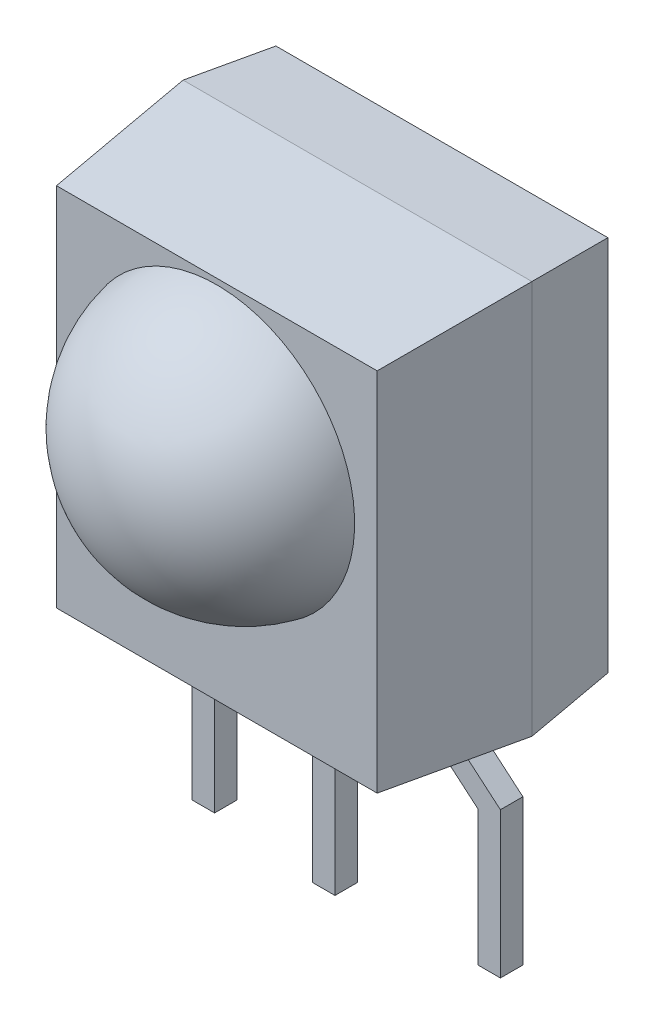
ISO-10303-21;
HEADER;
FILE_DESCRIPTION(('STEP AP214'),'2;1');
FILE_NAME('part.step','',(''),(''),'','','');
FILE_SCHEMA(('AUTOMOTIVE_DESIGN { 1 0 10303 214 1 1 1 1 }'));
ENDSEC;
DATA;
#1=APPLICATION_CONTEXT('core data for automotive mechanical design processes');
#2=APPLICATION_PROTOCOL_DEFINITION('international standard','automotive_design',2000,#1);
#3=PRODUCT_CONTEXT('',#1,'mechanical');
#4=PRODUCT('Part','Part','',(#3));
#5=PRODUCT_RELATED_PRODUCT_CATEGORY('part','',(#4));
#6=PRODUCT_DEFINITION_FORMATION('','',#4);
#7=PRODUCT_DEFINITION_CONTEXT('part definition',#1,'design');
#8=PRODUCT_DEFINITION('design','',#6,#7);
#9=PRODUCT_DEFINITION_SHAPE('','',#8);
#10=(LENGTH_UNIT() NAMED_UNIT(*) SI_UNIT(.MILLI.,.METRE.));
#11=(NAMED_UNIT(*) PLANE_ANGLE_UNIT() SI_UNIT($,.RADIAN.));
#12=(NAMED_UNIT(*) SI_UNIT($,.STERADIAN.) SOLID_ANGLE_UNIT());
#13=UNCERTAINTY_MEASURE_WITH_UNIT(LENGTH_MEASURE(1.E-05),#10,'distance_accuracy_value','');
#14=(GEOMETRIC_REPRESENTATION_CONTEXT(3) GLOBAL_UNCERTAINTY_ASSIGNED_CONTEXT((#13)) GLOBAL_UNIT_ASSIGNED_CONTEXT((#10,
#11,#12)) REPRESENTATION_CONTEXT('',''));
#15=CARTESIAN_POINT('',(0.,0.,0.));
#16=DIRECTION('',(0.,0.,1.));
#17=DIRECTION('',(1.,0.,0.));
#18=AXIS2_PLACEMENT_3D('',#15,#16,#17);
#19=CARTESIAN_POINT('',(-0.399999999999999,-3.5,0.4));
#20=DIRECTION('',(1.,0.,0.));
#21=DIRECTION('',(0.,1.,0.));
#22=AXIS2_PLACEMENT_3D('',#19,#20,#21);
#23=PLANE('',#22);
#24=DIRECTION('',(0.,-1.,0.));
#25=VECTOR('',#24,1.);
#26=CARTESIAN_POINT('',(-0.399999999999999,-3.5,0.));
#27=LINE('',#26,#25);
#28=CARTESIAN_POINT('',(-0.399999999999999,-3.5,0.));
#29=VERTEX_POINT('',#28);
#30=CARTESIAN_POINT('',(-0.399999999999999,-7.3,0.));
#31=VERTEX_POINT('',#30);
#32=EDGE_CURVE('E109',#29,#31,#27,.T.);
#33=ORIENTED_EDGE('',*,*,#32,.T.);
#34=DIRECTION('',(0.,0.,-1.));
#35=VECTOR('',#34,1.);
#36=CARTESIAN_POINT('',(-0.399999999999999,-7.3,0.4));
#37=LINE('',#36,#35);
#38=CARTESIAN_POINT('',(-0.399999999999999,-7.3,0.4));
#39=VERTEX_POINT('',#38);
#40=EDGE_CURVE('E12',#39,#31,#37,.T.);
#41=ORIENTED_EDGE('',*,*,#40,.F.);
#42=DIRECTION('',(0.,-1.,0.));
#43=VECTOR('',#42,1.);
#44=CARTESIAN_POINT('',(-0.399999999999999,-3.5,0.4));
#45=LINE('',#44,#43);
#46=CARTESIAN_POINT('',(-0.399999999999999,-3.5,0.4));
#47=VERTEX_POINT('',#46);
#48=EDGE_CURVE('E86',#47,#39,#45,.T.);
#49=ORIENTED_EDGE('',*,*,#48,.F.);
#50=DIRECTION('',(0.,0.,-1.));
#51=VECTOR('',#50,1.);
#52=CARTESIAN_POINT('',(-0.399999999999999,-3.5,0.4));
#53=LINE('',#52,#51);
#54=EDGE_CURVE('E62',#47,#29,#53,.T.);
#55=ORIENTED_EDGE('',*,*,#54,.T.);
#56=EDGE_LOOP('',(#33,#41,#49,#55));
#57=FACE_BOUND('',#56,.T.);
#58=ADVANCED_FACE('F46',(#57),#23,.F.);
#59=CARTESIAN_POINT('',(0.,-7.3,0.4));
#60=DIRECTION('',(0.,-1.,0.));
#61=DIRECTION('',(0.,0.,-1.));
#62=AXIS2_PLACEMENT_3D('',#59,#60,#61);
#63=PLANE('',#62);
#64=DIRECTION('',(-1.,0.,0.));
#65=VECTOR('',#64,1.);
#66=CARTESIAN_POINT('',(0.,-7.3,0.));
#67=LINE('',#66,#65);
#68=CARTESIAN_POINT('',(0.,-7.3,0.));
#69=VERTEX_POINT('',#68);
#70=EDGE_CURVE('E95',#69,#31,#67,.T.);
#71=ORIENTED_EDGE('',*,*,#70,.F.);
#72=DIRECTION('',(0.,0.,-1.));
#73=VECTOR('',#72,1.);
#74=CARTESIAN_POINT('',(0.,-7.3,0.4));
#75=LINE('',#74,#73);
#76=CARTESIAN_POINT('',(0.,-7.3,0.4));
#77=VERTEX_POINT('',#76);
#78=EDGE_CURVE('E54',#77,#69,#75,.T.);
#79=ORIENTED_EDGE('',*,*,#78,.F.);
#80=DIRECTION('',(-1.,0.,0.));
#81=VECTOR('',#80,1.);
#82=CARTESIAN_POINT('',(0.,-7.3,0.4));
#83=LINE('',#82,#81);
#84=EDGE_CURVE('E93',#77,#39,#83,.T.);
#85=ORIENTED_EDGE('',*,*,#84,.T.);
#86=ORIENTED_EDGE('',*,*,#40,.T.);
#87=EDGE_LOOP('',(#71,#79,#85,#86));
#88=FACE_BOUND('',#87,.T.);
#89=ADVANCED_FACE('F92',(#88),#63,.T.);
#90=CARTESIAN_POINT('',(0.,-3.5,0.4));
#91=DIRECTION('',(1.,0.,0.));
#92=DIRECTION('',(0.,1.,0.));
#93=AXIS2_PLACEMENT_3D('',#90,#91,#92);
#94=PLANE('',#93);
#95=DIRECTION('',(0.,-1.,0.));
#96=VECTOR('',#95,1.);
#97=CARTESIAN_POINT('',(0.,-3.5,0.));
#98=LINE('',#97,#96);
#99=CARTESIAN_POINT('',(0.,-3.5,0.));
#100=VERTEX_POINT('',#99);
#101=EDGE_CURVE('E112',#100,#69,#98,.T.);
#102=ORIENTED_EDGE('',*,*,#101,.F.);
#103=DIRECTION('',(0.,0.,-1.));
#104=VECTOR('',#103,1.);
#105=CARTESIAN_POINT('',(0.,-3.5,0.4));
#106=LINE('',#105,#104);
#107=CARTESIAN_POINT('',(0.,-3.5,0.4));
#108=VERTEX_POINT('',#107);
#109=EDGE_CURVE('E75',#108,#100,#106,.T.);
#110=ORIENTED_EDGE('',*,*,#109,.F.);
#111=DIRECTION('',(0.,-1.,0.));
#112=VECTOR('',#111,1.);
#113=CARTESIAN_POINT('',(0.,-3.5,0.4));
#114=LINE('',#113,#112);
#115=EDGE_CURVE('E101',#108,#77,#114,.T.);
#116=ORIENTED_EDGE('',*,*,#115,.T.);
#117=ORIENTED_EDGE('',*,*,#78,.T.);
#118=EDGE_LOOP('',(#102,#110,#116,#117));
#119=FACE_BOUND('',#118,.T.);
#120=ADVANCED_FACE('F103',(#119),#94,.T.);
#121=CARTESIAN_POINT('',(-0.399999999999999,-3.5,0.4));
#122=DIRECTION('',(0.,1.,0.));
#123=DIRECTION('',(0.,0.,1.));
#124=AXIS2_PLACEMENT_3D('',#121,#122,#123);
#125=PLANE('',#124);
#126=DIRECTION('',(1.,0.,0.));
#127=VECTOR('',#126,1.);
#128=CARTESIAN_POINT('',(-0.399999999999999,-3.5,0.));
#129=LINE('',#128,#127);
#130=EDGE_CURVE('E114',#29,#100,#129,.T.);
#131=ORIENTED_EDGE('',*,*,#130,.F.);
#132=ORIENTED_EDGE('',*,*,#54,.F.);
#133=DIRECTION('',(1.,0.,0.));
#134=VECTOR('',#133,1.);
#135=CARTESIAN_POINT('',(-0.399999999999999,-3.5,0.4));
#136=LINE('',#135,#134);
#137=EDGE_CURVE('E104',#47,#108,#136,.T.);
#138=ORIENTED_EDGE('',*,*,#137,.T.);
#139=ORIENTED_EDGE('',*,*,#109,.T.);
#140=EDGE_LOOP('',(#131,#132,#138,#139));
#141=FACE_BOUND('',#140,.T.);
#142=ADVANCED_FACE('F120',(#141),#125,.T.);
#143=CARTESIAN_POINT('',(0.,0.,0.4));
#144=DIRECTION('',(0.,0.,-1.));
#145=DIRECTION('',(-1.,0.,0.));
#146=AXIS2_PLACEMENT_3D('',#143,#144,#145);
#147=PLANE('',#146);
#148=ORIENTED_EDGE('',*,*,#48,.T.);
#149=ORIENTED_EDGE('',*,*,#84,.F.);
#150=ORIENTED_EDGE('',*,*,#115,.F.);
#151=ORIENTED_EDGE('',*,*,#137,.F.);
#152=EDGE_LOOP('',(#148,#149,#150,#151));
#153=FACE_BOUND('',#152,.T.);
#154=ADVANCED_FACE('F100',(#153),#147,.F.);
#155=CARTESIAN_POINT('',(0.,0.,0.));
#156=DIRECTION('',(0.,0.,-1.));
#157=DIRECTION('',(-1.,0.,0.));
#158=AXIS2_PLACEMENT_3D('',#155,#156,#157);
#159=PLANE('',#158);
#160=ORIENTED_EDGE('',*,*,#32,.F.);
#161=ORIENTED_EDGE('',*,*,#130,.T.);
#162=ORIENTED_EDGE('',*,*,#101,.T.);
#163=ORIENTED_EDGE('',*,*,#70,.T.);
#164=EDGE_LOOP('',(#160,#161,#162,#163));
#165=FACE_BOUND('',#164,.T.);
#166=ADVANCED_FACE('F119',(#165),#159,.T.);
#167=CLOSED_SHELL('',(#58,#89,#120,#142,#154,#166));
#168=MANIFOLD_SOLID_BREP('B2',#167);
#169=CARTESIAN_POINT('',(-2.34,-4.8026672029627,0.2));
#170=DIRECTION('',(-1.,0.,0.));
#171=DIRECTION('',(0.,1.,0.));
#172=AXIS2_PLACEMENT_3D('',#169,#170,#171);
#173=PLANE('',#172);
#174=DIRECTION('',(0.,-1.,0.));
#175=VECTOR('',#174,1.);
#176=CARTESIAN_POINT('',(-2.34,-4.8026672029627,-0.2));
#177=LINE('',#176,#175);
#178=CARTESIAN_POINT('',(-2.34,-4.89526217276128,-0.2));
#179=VERTEX_POINT('',#178);
#180=CARTESIAN_POINT('',(-2.34,-7.3,-0.2));
#181=VERTEX_POINT('',#180);
#182=EDGE_CURVE('E276',#179,#181,#177,.T.);
#183=ORIENTED_EDGE('',*,*,#182,.F.);
#184=DIRECTION('',(0.,0.,-1.));
#185=VECTOR('',#184,1.);
#186=CARTESIAN_POINT('',(-2.34,-4.89526217276128,0.2));
#187=LINE('',#186,#185);
#188=CARTESIAN_POINT('',(-2.34,-4.89526217276128,0.2));
#189=VERTEX_POINT('',#188);
#190=EDGE_CURVE('E275',#189,#179,#187,.T.);
#191=ORIENTED_EDGE('',*,*,#190,.F.);
#192=DIRECTION('',(0.,-1.,0.));
#193=VECTOR('',#192,1.);
#194=CARTESIAN_POINT('',(-2.34,-4.8026672029627,0.2));
#195=LINE('',#194,#193);
#196=CARTESIAN_POINT('',(-2.34,-7.3,0.2));
#197=VERTEX_POINT('',#196);
#198=EDGE_CURVE('E290',#189,#197,#195,.T.);
#199=ORIENTED_EDGE('',*,*,#198,.T.);
#200=DIRECTION('',(0.,0.,-1.));
#201=VECTOR('',#200,1.);
#202=CARTESIAN_POINT('',(-2.34,-7.3,0.2));
#203=LINE('',#202,#201);
#204=EDGE_CURVE('E44',#197,#181,#203,.T.);
#205=ORIENTED_EDGE('',*,*,#204,.T.);
#206=EDGE_LOOP('',(#183,#191,#199,#205));
#207=FACE_BOUND('',#206,.T.);
#208=ADVANCED_FACE('F180',(#207),#173,.F.);
#209=CARTESIAN_POINT('',(-2.74,-7.3,0.2));
#210=DIRECTION('',(0.,-1.,0.));
#211=DIRECTION('',(0.,0.,-1.));
#212=AXIS2_PLACEMENT_3D('',#209,#210,#211);
#213=PLANE('',#212);
#214=DIRECTION('',(1.,0.,0.));
#215=VECTOR('',#214,1.);
#216=CARTESIAN_POINT('',(-2.74,-7.3,-0.2));
#217=LINE('',#216,#215);
#218=CARTESIAN_POINT('',(-2.74,-7.3,-0.2));
#219=VERTEX_POINT('',#218);
#220=EDGE_CURVE('E278',#219,#181,#217,.T.);
#221=ORIENTED_EDGE('',*,*,#220,.T.);
#222=ORIENTED_EDGE('',*,*,#204,.F.);
#223=DIRECTION('',(1.,0.,0.));
#224=VECTOR('',#223,1.);
#225=CARTESIAN_POINT('',(-2.74,-7.3,0.2));
#226=LINE('',#225,#224);
#227=CARTESIAN_POINT('',(-2.74,-7.3,0.2));
#228=VERTEX_POINT('',#227);
#229=EDGE_CURVE('E234',#228,#197,#226,.T.);
#230=ORIENTED_EDGE('',*,*,#229,.F.);
#231=DIRECTION('',(0.,0.,-1.));
#232=VECTOR('',#231,1.);
#233=CARTESIAN_POINT('',(-2.74,-7.3,0.2));
#234=LINE('',#233,#232);
#235=EDGE_CURVE('E188',#228,#219,#234,.T.);
#236=ORIENTED_EDGE('',*,*,#235,.T.);
#237=EDGE_LOOP('',(#221,#222,#230,#236));
#238=FACE_BOUND('',#237,.T.);
#239=ADVANCED_FACE('F303',(#238),#213,.T.);
#240=CARTESIAN_POINT('',(-2.74,-4.8026672029627,0.2));
#241=DIRECTION('',(-1.,0.,0.));
#242=DIRECTION('',(0.,1.,0.));
#243=AXIS2_PLACEMENT_3D('',#240,#241,#242);
#244=PLANE('',#243);
#245=DIRECTION('',(0.,-1.,0.));
#246=VECTOR('',#245,1.);
#247=CARTESIAN_POINT('',(-2.74,-4.8026672029627,-0.2));
#248=LINE('',#247,#246);
#249=CARTESIAN_POINT('',(-2.74,-4.71007223316413,-0.2));
#250=VERTEX_POINT('',#249);
#251=EDGE_CURVE('E280',#250,#219,#248,.T.);
#252=ORIENTED_EDGE('',*,*,#251,.T.);
#253=ORIENTED_EDGE('',*,*,#235,.F.);
#254=DIRECTION('',(0.,-1.,0.));
#255=VECTOR('',#254,1.);
#256=CARTESIAN_POINT('',(-2.74,-4.8026672029627,0.2));
#257=LINE('',#256,#255);
#258=CARTESIAN_POINT('',(-2.74,-4.71007223316413,0.2));
#259=VERTEX_POINT('',#258);
#260=EDGE_CURVE('E314',#259,#228,#257,.T.);
#261=ORIENTED_EDGE('',*,*,#260,.F.);
#262=DIRECTION('',(0.,0.,-1.));
#263=VECTOR('',#262,1.);
#264=CARTESIAN_POINT('',(-2.74,-4.71007223316413,0.2));
#265=LINE('',#264,#263);
#266=EDGE_CURVE('E297',#259,#250,#265,.T.);
#267=ORIENTED_EDGE('',*,*,#266,.T.);
#268=EDGE_LOOP('',(#252,#253,#261,#267));
#269=FACE_BOUND('',#268,.T.);
#270=ADVANCED_FACE('F322',(#269),#244,.T.);
#271=CARTESIAN_POINT('',(-1.93421000880941,-4.02637163457817,0.2));
#272=DIRECTION('',(-0.646977448195095,0.762509135372792,0.));
#273=DIRECTION('',(0.762509135372792,0.646977448195095,0.));
#274=AXIS2_PLACEMENT_3D('',#271,#272,#273);
#275=PLANE('',#274);
#276=DIRECTION('',(-0.762509135372792,-0.646977448195095,0.));
#277=VECTOR('',#276,1.);
#278=CARTESIAN_POINT('',(-1.93421000880941,-4.02637163457817,-0.2));
#279=LINE('',#278,#277);
#280=CARTESIAN_POINT('',(-2.00481451917039,-4.08627849185416,-0.2));
#281=VERTEX_POINT('',#280);
#282=EDGE_CURVE('E282',#281,#250,#279,.T.);
#283=ORIENTED_EDGE('',*,*,#282,.T.);
#284=ORIENTED_EDGE('',*,*,#266,.F.);
#285=DIRECTION('',(-0.762509135372792,-0.646977448195095,0.));
#286=VECTOR('',#285,1.);
#287=CARTESIAN_POINT('',(-1.93421000880941,-4.02637163457817,0.2));
#288=LINE('',#287,#286);
#289=CARTESIAN_POINT('',(-2.00481451917039,-4.08627849185416,0.2));
#290=VERTEX_POINT('',#289);
#291=EDGE_CURVE('E270',#290,#259,#288,.T.);
#292=ORIENTED_EDGE('',*,*,#291,.F.);
#293=DIRECTION('',(0.,0.,-1.));
#294=VECTOR('',#293,1.);
#295=CARTESIAN_POINT('',(-2.00481451917039,-4.08627849185416,0.2));
#296=LINE('',#295,#294);
#297=EDGE_CURVE('E294',#290,#281,#296,.T.);
#298=ORIENTED_EDGE('',*,*,#297,.T.);
#299=EDGE_LOOP('',(#283,#284,#292,#298));
#300=FACE_BOUND('',#299,.T.);
#301=ADVANCED_FACE('F321',(#300),#275,.T.);
#302=CARTESIAN_POINT('',(-2.00481451917039,-3.5,0.2));
#303=DIRECTION('',(-1.,0.,0.));
#304=DIRECTION('',(0.,0.,-1.));
#305=AXIS2_PLACEMENT_3D('',#302,#303,#304);
#306=PLANE('',#305);
#307=DIRECTION('',(0.,1.,0.));
#308=VECTOR('',#307,1.);
#309=CARTESIAN_POINT('',(-2.00481451917039,-3.5,-0.2));
#310=LINE('',#309,#308);
#311=CARTESIAN_POINT('',(-2.00481451917039,-3.5,-0.2));
#312=VERTEX_POINT('',#311);
#313=EDGE_CURVE('E284',#312,#281,#310,.F.);
#314=ORIENTED_EDGE('',*,*,#313,.T.);
#315=ORIENTED_EDGE('',*,*,#297,.F.);
#316=DIRECTION('',(0.,1.,0.));
#317=VECTOR('',#316,1.);
#318=CARTESIAN_POINT('',(-2.00481451917039,-3.5,0.2));
#319=LINE('',#318,#317);
#320=CARTESIAN_POINT('',(-2.00481451917039,-3.5,0.2));
#321=VERTEX_POINT('',#320);
#322=EDGE_CURVE('E268',#321,#290,#319,.F.);
#323=ORIENTED_EDGE('',*,*,#322,.F.);
#324=DIRECTION('',(0.,0.,-1.));
#325=VECTOR('',#324,1.);
#326=CARTESIAN_POINT('',(-2.00481451917039,-3.5,0.2));
#327=LINE('',#326,#325);
#328=EDGE_CURVE('E262',#321,#312,#327,.T.);
#329=ORIENTED_EDGE('',*,*,#328,.T.);
#330=EDGE_LOOP('',(#314,#315,#323,#329));
#331=FACE_BOUND('',#330,.T.);
#332=ADVANCED_FACE('F329',(#331),#306,.T.);
#333=CARTESIAN_POINT('',(-1.60481451917039,-3.5,0.2));
#334=DIRECTION('',(0.,1.,0.));
#335=DIRECTION('',(0.,0.,1.));
#336=AXIS2_PLACEMENT_3D('',#333,#334,#335);
#337=PLANE('',#336);
#338=DIRECTION('',(-1.,0.,0.));
#339=VECTOR('',#338,1.);
#340=CARTESIAN_POINT('',(-1.60481451917039,-3.5,-0.2));
#341=LINE('',#340,#339);
#342=CARTESIAN_POINT('',(-1.60481451917039,-3.5,-0.2));
#343=VERTEX_POINT('',#342);
#344=EDGE_CURVE('E286',#343,#312,#341,.T.);
#345=ORIENTED_EDGE('',*,*,#344,.T.);
#346=ORIENTED_EDGE('',*,*,#328,.F.);
#347=DIRECTION('',(-1.,0.,0.));
#348=VECTOR('',#347,1.);
#349=CARTESIAN_POINT('',(-1.60481451917039,-3.5,0.2));
#350=LINE('',#349,#348);
#351=CARTESIAN_POINT('',(-1.60481451917039,-3.5,0.2));
#352=VERTEX_POINT('',#351);
#353=EDGE_CURVE('E252',#352,#321,#350,.T.);
#354=ORIENTED_EDGE('',*,*,#353,.F.);
#355=DIRECTION('',(0.,0.,-1.));
#356=VECTOR('',#355,1.);
#357=CARTESIAN_POINT('',(-1.60481451917039,-3.5,0.2));
#358=LINE('',#357,#356);
#359=EDGE_CURVE('E257',#352,#343,#358,.T.);
#360=ORIENTED_EDGE('',*,*,#359,.T.);
#361=EDGE_LOOP('',(#345,#346,#354,#360));
#362=FACE_BOUND('',#361,.T.);
#363=ADVANCED_FACE('F265',(#362),#337,.T.);
#364=CARTESIAN_POINT('',(-1.60481451917039,-3.5,0.2));
#365=DIRECTION('',(-1.,0.,0.));
#366=DIRECTION('',(0.,0.,-1.));
#367=AXIS2_PLACEMENT_3D('',#364,#365,#366);
#368=PLANE('',#367);
#369=DIRECTION('',(0.,1.,0.));
#370=VECTOR('',#369,1.);
#371=CARTESIAN_POINT('',(-1.60481451917039,-3.5,-0.2));
#372=LINE('',#371,#370);
#373=CARTESIAN_POINT('',(-1.60481451917039,-4.27146843145131,-0.2));
#374=VERTEX_POINT('',#373);
#375=EDGE_CURVE('E259',#343,#374,#372,.F.);
#376=ORIENTED_EDGE('',*,*,#375,.F.);
#377=ORIENTED_EDGE('',*,*,#359,.F.);
#378=DIRECTION('',(0.,1.,0.));
#379=VECTOR('',#378,1.);
#380=CARTESIAN_POINT('',(-1.60481451917039,-3.5,0.2));
#381=LINE('',#380,#379);
#382=CARTESIAN_POINT('',(-1.60481451917039,-4.27146843145131,0.2));
#383=VERTEX_POINT('',#382);
#384=EDGE_CURVE('E248',#352,#383,#381,.F.);
#385=ORIENTED_EDGE('',*,*,#384,.T.);
#386=DIRECTION('',(0.,0.,-1.));
#387=VECTOR('',#386,1.);
#388=CARTESIAN_POINT('',(-1.60481451917039,-4.27146843145131,0.2));
#389=LINE('',#388,#387);
#390=EDGE_CURVE('E263',#383,#374,#389,.T.);
#391=ORIENTED_EDGE('',*,*,#390,.T.);
#392=EDGE_LOOP('',(#376,#377,#385,#391));
#393=FACE_BOUND('',#392,.T.);
#394=ADVANCED_FACE('F258',(#393),#368,.F.);
#395=CARTESIAN_POINT('',(-1.67541902953137,-4.33137528872729,0.2));
#396=DIRECTION('',(-0.646977448195095,0.762509135372792,0.));
#397=DIRECTION('',(0.762509135372792,0.646977448195095,0.));
#398=AXIS2_PLACEMENT_3D('',#395,#396,#397);
#399=PLANE('',#398);
#400=DIRECTION('',(-0.762509135372792,-0.646977448195095,0.));
#401=VECTOR('',#400,1.);
#402=CARTESIAN_POINT('',(-1.67541902953137,-4.33137528872729,-0.2));
#403=LINE('',#402,#401);
#404=EDGE_CURVE('E222',#374,#179,#403,.T.);
#405=ORIENTED_EDGE('',*,*,#404,.F.);
#406=ORIENTED_EDGE('',*,*,#390,.F.);
#407=DIRECTION('',(-0.762509135372792,-0.646977448195095,0.));
#408=VECTOR('',#407,1.);
#409=CARTESIAN_POINT('',(-1.67541902953137,-4.33137528872729,0.2));
#410=LINE('',#409,#408);
#411=EDGE_CURVE('E196',#383,#189,#410,.T.);
#412=ORIENTED_EDGE('',*,*,#411,.T.);
#413=ORIENTED_EDGE('',*,*,#190,.T.);
#414=EDGE_LOOP('',(#405,#406,#412,#413));
#415=FACE_BOUND('',#414,.T.);
#416=ADVANCED_FACE('F374',(#415),#399,.F.);
#417=CARTESIAN_POINT('',(0.,0.,0.2));
#418=DIRECTION('',(0.,0.,-1.));
#419=DIRECTION('',(1.,0.,0.));
#420=AXIS2_PLACEMENT_3D('',#417,#418,#419);
#421=PLANE('',#420);
#422=ORIENTED_EDGE('',*,*,#198,.F.);
#423=ORIENTED_EDGE('',*,*,#411,.F.);
#424=ORIENTED_EDGE('',*,*,#384,.F.);
#425=ORIENTED_EDGE('',*,*,#353,.T.);
#426=ORIENTED_EDGE('',*,*,#322,.T.);
#427=ORIENTED_EDGE('',*,*,#291,.T.);
#428=ORIENTED_EDGE('',*,*,#260,.T.);
#429=ORIENTED_EDGE('',*,*,#229,.T.);
#430=EDGE_LOOP('',(#422,#423,#424,#425,#426,#427,#428,#429));
#431=FACE_BOUND('',#430,.T.);
#432=ADVANCED_FACE('F250',(#431),#421,.F.);
#433=CARTESIAN_POINT('',(0.,0.,-0.2));
#434=DIRECTION('',(0.,0.,-1.));
#435=DIRECTION('',(1.,0.,0.));
#436=AXIS2_PLACEMENT_3D('',#433,#434,#435);
#437=PLANE('',#436);
#438=ORIENTED_EDGE('',*,*,#182,.T.);
#439=ORIENTED_EDGE('',*,*,#220,.F.);
#440=ORIENTED_EDGE('',*,*,#251,.F.);
#441=ORIENTED_EDGE('',*,*,#282,.F.);
#442=ORIENTED_EDGE('',*,*,#313,.F.);
#443=ORIENTED_EDGE('',*,*,#344,.F.);
#444=ORIENTED_EDGE('',*,*,#375,.T.);
#445=ORIENTED_EDGE('',*,*,#404,.T.);
#446=EDGE_LOOP('',(#438,#439,#440,#441,#442,#443,#444,#445));
#447=FACE_BOUND('',#446,.T.);
#448=ADVANCED_FACE('F307',(#447),#437,.T.);
#449=CLOSED_SHELL('',(#208,#239,#270,#301,#332,#363,#394,#416,#432,#448));
#450=MANIFOLD_SOLID_BREP('B6',#449);
#451=CARTESIAN_POINT('',(2.34,-4.8026672029627,0.2));
#452=DIRECTION('',(1.,0.,0.));
#453=DIRECTION('',(0.,1.,0.));
#454=AXIS2_PLACEMENT_3D('',#451,#452,#453);
#455=PLANE('',#454);
#456=DIRECTION('',(0.,-1.,0.));
#457=VECTOR('',#456,1.);
#458=CARTESIAN_POINT('',(2.34,-4.8026672029627,-0.2));
#459=LINE('',#458,#457);
#460=CARTESIAN_POINT('',(2.34,-4.89526217276128,-0.2));
#461=VERTEX_POINT('',#460);
#462=CARTESIAN_POINT('',(2.34,-7.3,-0.2));
#463=VERTEX_POINT('',#462);
#464=EDGE_CURVE('E514',#461,#463,#459,.T.);
#465=ORIENTED_EDGE('',*,*,#464,.T.);
#466=DIRECTION('',(0.,0.,-1.));
#467=VECTOR('',#466,1.);
#468=CARTESIAN_POINT('',(2.34,-7.3,0.2));
#469=LINE('',#468,#467);
#470=CARTESIAN_POINT('',(2.34,-7.3,0.2));
#471=VERTEX_POINT('',#470);
#472=EDGE_CURVE('E178',#471,#463,#469,.T.);
#473=ORIENTED_EDGE('',*,*,#472,.F.);
#474=DIRECTION('',(0.,-1.,0.));
#475=VECTOR('',#474,1.);
#476=CARTESIAN_POINT('',(2.34,-4.8026672029627,0.2));
#477=LINE('',#476,#475);
#478=CARTESIAN_POINT('',(2.34,-4.89526217276128,0.2));
#479=VERTEX_POINT('',#478);
#480=EDGE_CURVE('E472',#479,#471,#477,.T.);
#481=ORIENTED_EDGE('',*,*,#480,.F.);
#482=DIRECTION('',(0.,0.,-1.));
#483=VECTOR('',#482,1.);
#484=CARTESIAN_POINT('',(2.34,-4.89526217276128,0.2));
#485=LINE('',#484,#483);
#486=EDGE_CURVE('E513',#479,#461,#485,.T.);
#487=ORIENTED_EDGE('',*,*,#486,.T.);
#488=EDGE_LOOP('',(#465,#473,#481,#487));
#489=FACE_BOUND('',#488,.T.);
#490=ADVANCED_FACE('F417',(#489),#455,.F.);
#491=CARTESIAN_POINT('',(2.74,-7.3,0.2));
#492=DIRECTION('',(0.,-1.,0.));
#493=DIRECTION('',(0.,0.,-1.));
#494=AXIS2_PLACEMENT_3D('',#491,#492,#493);
#495=PLANE('',#494);
#496=DIRECTION('',(-1.,0.,0.));
#497=VECTOR('',#496,1.);
#498=CARTESIAN_POINT('',(2.74,-7.3,-0.2));
#499=LINE('',#498,#497);
#500=CARTESIAN_POINT('',(2.74,-7.3,-0.2));
#501=VERTEX_POINT('',#500);
#502=EDGE_CURVE('E517',#501,#463,#499,.T.);
#503=ORIENTED_EDGE('',*,*,#502,.F.);
#504=DIRECTION('',(0.,0.,-1.));
#505=VECTOR('',#504,1.);
#506=CARTESIAN_POINT('',(2.74,-7.3,0.2));
#507=LINE('',#506,#505);
#508=CARTESIAN_POINT('',(2.74,-7.3,0.2));
#509=VERTEX_POINT('',#508);
#510=EDGE_CURVE('E425',#509,#501,#507,.T.);
#511=ORIENTED_EDGE('',*,*,#510,.F.);
#512=DIRECTION('',(-1.,0.,0.));
#513=VECTOR('',#512,1.);
#514=CARTESIAN_POINT('',(2.74,-7.3,0.2));
#515=LINE('',#514,#513);
#516=EDGE_CURVE('E556',#509,#471,#515,.T.);
#517=ORIENTED_EDGE('',*,*,#516,.T.);
#518=ORIENTED_EDGE('',*,*,#472,.T.);
#519=EDGE_LOOP('',(#503,#511,#517,#518));
#520=FACE_BOUND('',#519,.T.);
#521=ADVANCED_FACE('F547',(#520),#495,.T.);
#522=CARTESIAN_POINT('',(2.74,-4.8026672029627,0.2));
#523=DIRECTION('',(1.,0.,0.));
#524=DIRECTION('',(0.,1.,0.));
#525=AXIS2_PLACEMENT_3D('',#522,#523,#524);
#526=PLANE('',#525);
#527=DIRECTION('',(0.,-1.,0.));
#528=VECTOR('',#527,1.);
#529=CARTESIAN_POINT('',(2.74,-4.8026672029627,-0.2));
#530=LINE('',#529,#528);
#531=CARTESIAN_POINT('',(2.74,-4.71007223316413,-0.2));
#532=VERTEX_POINT('',#531);
#533=EDGE_CURVE('E520',#532,#501,#530,.T.);
#534=ORIENTED_EDGE('',*,*,#533,.F.);
#535=DIRECTION('',(0.,0.,-1.));
#536=VECTOR('',#535,1.);
#537=CARTESIAN_POINT('',(2.74,-4.71007223316413,0.2));
#538=LINE('',#537,#536);
#539=CARTESIAN_POINT('',(2.74,-4.71007223316413,0.2));
#540=VERTEX_POINT('',#539);
#541=EDGE_CURVE('E537',#540,#532,#538,.T.);
#542=ORIENTED_EDGE('',*,*,#541,.F.);
#543=DIRECTION('',(0.,-1.,0.));
#544=VECTOR('',#543,1.);
#545=CARTESIAN_POINT('',(2.74,-4.8026672029627,0.2));
#546=LINE('',#545,#544);
#547=EDGE_CURVE('E544',#540,#509,#546,.T.);
#548=ORIENTED_EDGE('',*,*,#547,.T.);
#549=ORIENTED_EDGE('',*,*,#510,.T.);
#550=EDGE_LOOP('',(#534,#542,#548,#549));
#551=FACE_BOUND('',#550,.T.);
#552=ADVANCED_FACE('F542',(#551),#526,.T.);
#553=CARTESIAN_POINT('',(1.93421000880941,-4.02637163457817,0.2));
#554=DIRECTION('',(0.646977448195095,0.762509135372792,0.));
#555=DIRECTION('',(-0.762509135372792,0.646977448195095,0.));
#556=AXIS2_PLACEMENT_3D('',#553,#554,#555);
#557=PLANE('',#556);
#558=DIRECTION('',(0.762509135372792,-0.646977448195095,0.));
#559=VECTOR('',#558,1.);
#560=CARTESIAN_POINT('',(1.93421000880941,-4.02637163457817,-0.2));
#561=LINE('',#560,#559);
#562=CARTESIAN_POINT('',(2.00481451917039,-4.08627849185416,-0.2));
#563=VERTEX_POINT('',#562);
#564=EDGE_CURVE('E523',#563,#532,#561,.T.);
#565=ORIENTED_EDGE('',*,*,#564,.F.);
#566=DIRECTION('',(0.,0.,-1.));
#567=VECTOR('',#566,1.);
#568=CARTESIAN_POINT('',(2.00481451917039,-4.08627849185416,0.2));
#569=LINE('',#568,#567);
#570=CARTESIAN_POINT('',(2.00481451917039,-4.08627849185416,0.2));
#571=VERTEX_POINT('',#570);
#572=EDGE_CURVE('E535',#571,#563,#569,.T.);
#573=ORIENTED_EDGE('',*,*,#572,.F.);
#574=DIRECTION('',(0.762509135372792,-0.646977448195095,0.));
#575=VECTOR('',#574,1.);
#576=CARTESIAN_POINT('',(1.93421000880941,-4.02637163457817,0.2));
#577=LINE('',#576,#575);
#578=EDGE_CURVE('E508',#571,#540,#577,.T.);
#579=ORIENTED_EDGE('',*,*,#578,.T.);
#580=ORIENTED_EDGE('',*,*,#541,.T.);
#581=EDGE_LOOP('',(#565,#573,#579,#580));
#582=FACE_BOUND('',#581,.T.);
#583=ADVANCED_FACE('F554',(#582),#557,.T.);
#584=CARTESIAN_POINT('',(2.00481451917039,-3.5,0.2));
#585=DIRECTION('',(1.,0.,0.));
#586=DIRECTION('',(0.,0.,-1.));
#587=AXIS2_PLACEMENT_3D('',#584,#585,#586);
#588=PLANE('',#587);
#589=DIRECTION('',(0.,1.,0.));
#590=VECTOR('',#589,1.);
#591=CARTESIAN_POINT('',(2.00481451917039,-3.5,-0.2));
#592=LINE('',#591,#590);
#593=CARTESIAN_POINT('',(2.00481451917039,-3.5,-0.2));
#594=VERTEX_POINT('',#593);
#595=EDGE_CURVE('E526',#594,#563,#592,.F.);
#596=ORIENTED_EDGE('',*,*,#595,.F.);
#597=DIRECTION('',(0.,0.,-1.));
#598=VECTOR('',#597,1.);
#599=CARTESIAN_POINT('',(2.00481451917039,-3.5,0.2));
#600=LINE('',#599,#598);
#601=CARTESIAN_POINT('',(2.00481451917039,-3.5,0.2));
#602=VERTEX_POINT('',#601);
#603=EDGE_CURVE('E496',#602,#594,#600,.T.);
#604=ORIENTED_EDGE('',*,*,#603,.F.);
#605=DIRECTION('',(0.,1.,0.));
#606=VECTOR('',#605,1.);
#607=CARTESIAN_POINT('',(2.00481451917039,-3.5,0.2));
#608=LINE('',#607,#606);
#609=EDGE_CURVE('E506',#602,#571,#608,.F.);
#610=ORIENTED_EDGE('',*,*,#609,.T.);
#611=ORIENTED_EDGE('',*,*,#572,.T.);
#612=EDGE_LOOP('',(#596,#604,#610,#611));
#613=FACE_BOUND('',#612,.T.);
#614=ADVANCED_FACE('F561',(#613),#588,.T.);
#615=CARTESIAN_POINT('',(1.60481451917039,-3.5,0.2));
#616=DIRECTION('',(0.,1.,0.));
#617=DIRECTION('',(0.,0.,1.));
#618=AXIS2_PLACEMENT_3D('',#615,#616,#617);
#619=PLANE('',#618);
#620=DIRECTION('',(1.,0.,0.));
#621=VECTOR('',#620,1.);
#622=CARTESIAN_POINT('',(1.60481451917039,-3.5,-0.2));
#623=LINE('',#622,#621);
#624=CARTESIAN_POINT('',(1.60481451917039,-3.5,-0.2));
#625=VERTEX_POINT('',#624);
#626=EDGE_CURVE('E495',#625,#594,#623,.T.);
#627=ORIENTED_EDGE('',*,*,#626,.F.);
#628=DIRECTION('',(0.,0.,-1.));
#629=VECTOR('',#628,1.);
#630=CARTESIAN_POINT('',(1.60481451917039,-3.5,0.2));
#631=LINE('',#630,#629);
#632=CARTESIAN_POINT('',(1.60481451917039,-3.5,0.2));
#633=VERTEX_POINT('',#632);
#634=EDGE_CURVE('E489',#633,#625,#631,.T.);
#635=ORIENTED_EDGE('',*,*,#634,.F.);
#636=DIRECTION('',(1.,0.,0.));
#637=VECTOR('',#636,1.);
#638=CARTESIAN_POINT('',(1.60481451917039,-3.5,0.2));
#639=LINE('',#638,#637);
#640=EDGE_CURVE('E493',#633,#602,#639,.T.);
#641=ORIENTED_EDGE('',*,*,#640,.T.);
#642=ORIENTED_EDGE('',*,*,#603,.T.);
#643=EDGE_LOOP('',(#627,#635,#641,#642));
#644=FACE_BOUND('',#643,.T.);
#645=ADVANCED_FACE('F491',(#644),#619,.T.);
#646=CARTESIAN_POINT('',(1.60481451917039,-3.5,0.2));
#647=DIRECTION('',(1.,0.,0.));
#648=DIRECTION('',(0.,0.,-1.));
#649=AXIS2_PLACEMENT_3D('',#646,#647,#648);
#650=PLANE('',#649);
#651=DIRECTION('',(0.,1.,0.));
#652=VECTOR('',#651,1.);
#653=CARTESIAN_POINT('',(1.60481451917039,-3.5,-0.2));
#654=LINE('',#653,#652);
#655=CARTESIAN_POINT('',(1.60481451917039,-4.27146843145131,-0.2));
#656=VERTEX_POINT('',#655);
#657=EDGE_CURVE('E460',#625,#656,#654,.F.);
#658=ORIENTED_EDGE('',*,*,#657,.T.);
#659=DIRECTION('',(0.,0.,-1.));
#660=VECTOR('',#659,1.);
#661=CARTESIAN_POINT('',(1.60481451917039,-4.27146843145131,0.2));
#662=LINE('',#661,#660);
#663=CARTESIAN_POINT('',(1.60481451917039,-4.27146843145131,0.2));
#664=VERTEX_POINT('',#663);
#665=EDGE_CURVE('E497',#664,#656,#662,.T.);
#666=ORIENTED_EDGE('',*,*,#665,.F.);
#667=DIRECTION('',(0.,1.,0.));
#668=VECTOR('',#667,1.);
#669=CARTESIAN_POINT('',(1.60481451917039,-3.5,0.2));
#670=LINE('',#669,#668);
#671=EDGE_CURVE('E499',#633,#664,#670,.F.);
#672=ORIENTED_EDGE('',*,*,#671,.F.);
#673=ORIENTED_EDGE('',*,*,#634,.T.);
#674=EDGE_LOOP('',(#658,#666,#672,#673));
#675=FACE_BOUND('',#674,.T.);
#676=ADVANCED_FACE('F500',(#675),#650,.F.);
#677=CARTESIAN_POINT('',(1.67541902953137,-4.33137528872729,0.2));
#678=DIRECTION('',(0.646977448195095,0.762509135372792,0.));
#679=DIRECTION('',(-0.762509135372792,0.646977448195095,0.));
#680=AXIS2_PLACEMENT_3D('',#677,#678,#679);
#681=PLANE('',#680);
#682=DIRECTION('',(0.762509135372792,-0.646977448195095,0.));
#683=VECTOR('',#682,1.);
#684=CARTESIAN_POINT('',(1.67541902953137,-4.33137528872729,-0.2));
#685=LINE('',#684,#683);
#686=EDGE_CURVE('E466',#656,#461,#685,.T.);
#687=ORIENTED_EDGE('',*,*,#686,.T.);
#688=ORIENTED_EDGE('',*,*,#486,.F.);
#689=DIRECTION('',(0.762509135372792,-0.646977448195095,0.));
#690=VECTOR('',#689,1.);
#691=CARTESIAN_POINT('',(1.67541902953137,-4.33137528872729,0.2));
#692=LINE('',#691,#690);
#693=EDGE_CURVE('E433',#664,#479,#692,.T.);
#694=ORIENTED_EDGE('',*,*,#693,.F.);
#695=ORIENTED_EDGE('',*,*,#665,.T.);
#696=EDGE_LOOP('',(#687,#688,#694,#695));
#697=FACE_BOUND('',#696,.T.);
#698=ADVANCED_FACE('F563',(#697),#681,.F.);
#699=CARTESIAN_POINT('',(0.,0.,0.2));
#700=DIRECTION('',(0.,0.,-1.));
#701=DIRECTION('',(-1.,0.,0.));
#702=AXIS2_PLACEMENT_3D('',#699,#700,#701);
#703=PLANE('',#702);
#704=ORIENTED_EDGE('',*,*,#480,.T.);
#705=ORIENTED_EDGE('',*,*,#516,.F.);
#706=ORIENTED_EDGE('',*,*,#547,.F.);
#707=ORIENTED_EDGE('',*,*,#578,.F.);
#708=ORIENTED_EDGE('',*,*,#609,.F.);
#709=ORIENTED_EDGE('',*,*,#640,.F.);
#710=ORIENTED_EDGE('',*,*,#671,.T.);
#711=ORIENTED_EDGE('',*,*,#693,.T.);
#712=EDGE_LOOP('',(#704,#705,#706,#707,#708,#709,#710,#711));
#713=FACE_BOUND('',#712,.T.);
#714=ADVANCED_FACE('F503',(#713),#703,.F.);
#715=CARTESIAN_POINT('',(0.,0.,-0.2));
#716=DIRECTION('',(0.,0.,-1.));
#717=DIRECTION('',(-1.,0.,0.));
#718=AXIS2_PLACEMENT_3D('',#715,#716,#717);
#719=PLANE('',#718);
#720=ORIENTED_EDGE('',*,*,#464,.F.);
#721=ORIENTED_EDGE('',*,*,#686,.F.);
#722=ORIENTED_EDGE('',*,*,#657,.F.);
#723=ORIENTED_EDGE('',*,*,#626,.T.);
#724=ORIENTED_EDGE('',*,*,#595,.T.);
#725=ORIENTED_EDGE('',*,*,#564,.T.);
#726=ORIENTED_EDGE('',*,*,#533,.T.);
#727=ORIENTED_EDGE('',*,*,#502,.T.);
#728=EDGE_LOOP('',(#720,#721,#722,#723,#724,#725,#726,#727));
#729=FACE_BOUND('',#728,.T.);
#730=ADVANCED_FACE('F550',(#729),#719,.T.);
#731=CLOSED_SHELL('',(#490,#521,#552,#583,#614,#645,#676,#698,#714,#730));
#732=MANIFOLD_SOLID_BREP('B38',#731);
#733=CARTESIAN_POINT('',(0.,0.,-1.5));
#734=DIRECTION('',(0.,0.,-1.));
#735=DIRECTION('',(-1.,0.,0.));
#736=AXIS2_PLACEMENT_3D('',#733,#734,#735);
#737=PLANE('',#736);
#738=DIRECTION('',(0.,1.,0.));
#739=VECTOR('',#738,1.);
#740=CARTESIAN_POINT('',(-2.95,0.,-1.5));
#741=LINE('',#740,#739);
#742=CARTESIAN_POINT('',(-2.95,-3.35,-1.5));
#743=VERTEX_POINT('',#742);
#744=CARTESIAN_POINT('',(-2.95,3.35,-1.5));
#745=VERTEX_POINT('',#744);
#746=EDGE_CURVE('E654',#743,#745,#741,.T.);
#747=ORIENTED_EDGE('',*,*,#746,.T.);
#748=DIRECTION('',(1.,0.,0.));
#749=VECTOR('',#748,1.);
#750=CARTESIAN_POINT('',(0.,3.35,-1.5));
#751=LINE('',#750,#749);
#752=CARTESIAN_POINT('',(2.95,3.35,-1.5));
#753=VERTEX_POINT('',#752);
#754=EDGE_CURVE('E415',#745,#753,#751,.T.);
#755=ORIENTED_EDGE('',*,*,#754,.T.);
#756=DIRECTION('',(0.,-1.,0.));
#757=VECTOR('',#756,1.);
#758=CARTESIAN_POINT('',(2.95,0.,-1.5));
#759=LINE('',#758,#757);
#760=CARTESIAN_POINT('',(2.95,-3.35,-1.5));
#761=VERTEX_POINT('',#760);
#762=EDGE_CURVE('E737',#753,#761,#759,.T.);
#763=ORIENTED_EDGE('',*,*,#762,.T.);
#764=DIRECTION('',(-1.,0.,0.));
#765=VECTOR('',#764,1.);
#766=CARTESIAN_POINT('',(0.,-3.35,-1.5));
#767=LINE('',#766,#765);
#768=EDGE_CURVE('E665',#761,#743,#767,.T.);
#769=ORIENTED_EDGE('',*,*,#768,.T.);
#770=EDGE_LOOP('',(#747,#755,#763,#769));
#771=FACE_BOUND('',#770,.T.);
#772=ADVANCED_FACE('F645',(#771),#737,.T.);
#773=CARTESIAN_POINT('',(0.,0.,2.5));
#774=DIRECTION('',(0.,0.,-1.));
#775=DIRECTION('',(-1.,0.,0.));
#776=AXIS2_PLACEMENT_3D('',#773,#774,#775);
#777=PLANE('',#776);
#778=CARTESIAN_POINT('',(0.,0.7,2.5));
#779=DIRECTION('',(0.,0.,-1.));
#780=DIRECTION('',(-1.,0.,0.));
#781=AXIS2_PLACEMENT_3D('',#778,#779,#780);
#782=CIRCLE('',#781,2.44948974278318);
#783=CARTESIAN_POINT('',(-2.44948974278318,0.7,2.5));
#784=VERTEX_POINT('',#783);
#785=EDGE_CURVE('E649',#784,#784,#782,.T.);
#786=ORIENTED_EDGE('',*,*,#785,.T.);
#787=EDGE_LOOP('',(#786));
#788=FACE_BOUND('',#787,.T.);
#789=DIRECTION('',(0.,-1.,0.));
#790=VECTOR('',#789,1.);
#791=CARTESIAN_POINT('',(-2.85,-3.5,2.5));
#792=LINE('',#791,#790);
#793=CARTESIAN_POINT('',(-2.85,3.25,2.5));
#794=VERTEX_POINT('',#793);
#795=CARTESIAN_POINT('',(-2.85,-3.25,2.5));
#796=VERTEX_POINT('',#795);
#797=EDGE_CURVE('E722',#794,#796,#792,.T.);
#798=ORIENTED_EDGE('',*,*,#797,.T.);
#799=DIRECTION('',(1.,0.,0.));
#800=VECTOR('',#799,1.);
#801=CARTESIAN_POINT('',(3.1,-3.25,2.5));
#802=LINE('',#801,#800);
#803=CARTESIAN_POINT('',(2.85,-3.25,2.5));
#804=VERTEX_POINT('',#803);
#805=EDGE_CURVE('E703',#796,#804,#802,.T.);
#806=ORIENTED_EDGE('',*,*,#805,.T.);
#807=DIRECTION('',(0.,1.,0.));
#808=VECTOR('',#807,1.);
#809=CARTESIAN_POINT('',(2.85,3.5,2.5));
#810=LINE('',#809,#808);
#811=CARTESIAN_POINT('',(2.85,3.25,2.5));
#812=VERTEX_POINT('',#811);
#813=EDGE_CURVE('E712',#804,#812,#810,.T.);
#814=ORIENTED_EDGE('',*,*,#813,.T.);
#815=DIRECTION('',(-1.,0.,0.));
#816=VECTOR('',#815,1.);
#817=CARTESIAN_POINT('',(-3.1,3.25,2.5));
#818=LINE('',#817,#816);
#819=EDGE_CURVE('E717',#812,#794,#818,.T.);
#820=ORIENTED_EDGE('',*,*,#819,.T.);
#821=EDGE_LOOP('',(#798,#806,#814,#820));
#822=FACE_BOUND('',#821,.T.);
#823=ADVANCED_FACE('F720',(#788,#822),#777,.F.);
#824=CARTESIAN_POINT('',(0.,3.25,2.5));
#825=DIRECTION('',(0.,0.995037190209989,0.0995037190209958));
#826=DIRECTION('',(1.,0.,0.));
#827=AXIS2_PLACEMENT_3D('',#824,#825,#826);
#828=PLANE('',#827);
#829=DIRECTION('',(-0.0990147542976643,-0.0990147542976643,0.990147542976675));
#830=VECTOR('',#829,1.);
#831=CARTESIAN_POINT('',(2.81813725490196,3.21813725490196,2.81862745098038));
#832=LINE('',#831,#830);
#833=CARTESIAN_POINT('',(3.1,3.5,0.));
#834=VERTEX_POINT('',#833);
#835=EDGE_CURVE('E714',#834,#812,#832,.T.);
#836=ORIENTED_EDGE('',*,*,#835,.F.);
#837=DIRECTION('',(1.,0.,0.));
#838=VECTOR('',#837,1.);
#839=CARTESIAN_POINT('',(3.1,3.5,0.));
#840=LINE('',#839,#838);
#841=CARTESIAN_POINT('',(-3.1,3.5,0.));
#842=VERTEX_POINT('',#841);
#843=EDGE_CURVE('E732',#842,#834,#840,.T.);
#844=ORIENTED_EDGE('',*,*,#843,.F.);
#845=DIRECTION('',(0.0990147542976643,-0.0990147542976643,0.990147542976675));
#846=VECTOR('',#845,1.);
#847=CARTESIAN_POINT('',(-2.82205882352941,3.22205882352941,2.77941176470587));
#848=LINE('',#847,#846);
#849=EDGE_CURVE('E718',#794,#842,#848,.F.);
#850=ORIENTED_EDGE('',*,*,#849,.F.);
#851=ORIENTED_EDGE('',*,*,#819,.F.);
#852=EDGE_LOOP('',(#836,#844,#850,#851));
#853=FACE_BOUND('',#852,.T.);
#854=ADVANCED_FACE('F770',(#853),#828,.T.);
#855=CARTESIAN_POINT('',(-2.85,0.,2.5));
#856=DIRECTION('',(-0.995037190209989,0.,0.0995037190209958));
#857=DIRECTION('',(0.,1.,0.));
#858=AXIS2_PLACEMENT_3D('',#855,#856,#857);
#859=PLANE('',#858);
#860=ORIENTED_EDGE('',*,*,#849,.T.);
#861=DIRECTION('',(0.,1.,0.));
#862=VECTOR('',#861,1.);
#863=CARTESIAN_POINT('',(-3.1,3.5,0.));
#864=LINE('',#863,#862);
#865=CARTESIAN_POINT('',(-3.1,-3.5,0.));
#866=VERTEX_POINT('',#865);
#867=EDGE_CURVE('E725',#866,#842,#864,.T.);
#868=ORIENTED_EDGE('',*,*,#867,.F.);
#869=DIRECTION('',(0.0990147542976643,0.0990147542976643,0.990147542976675));
#870=VECTOR('',#869,1.);
#871=CARTESIAN_POINT('',(-2.81813725490196,-3.21813725490196,2.81862745098038));
#872=LINE('',#871,#870);
#873=EDGE_CURVE('E708',#796,#866,#872,.F.);
#874=ORIENTED_EDGE('',*,*,#873,.F.);
#875=ORIENTED_EDGE('',*,*,#797,.F.);
#876=EDGE_LOOP('',(#860,#868,#874,#875));
#877=FACE_BOUND('',#876,.T.);
#878=ADVANCED_FACE('F779',(#877),#859,.T.);
#879=CARTESIAN_POINT('',(2.85,0.,2.5));
#880=DIRECTION('',(0.995037190209989,0.,0.0995037190209958));
#881=DIRECTION('',(0.,-1.,0.));
#882=AXIS2_PLACEMENT_3D('',#879,#880,#881);
#883=PLANE('',#882);
#884=ORIENTED_EDGE('',*,*,#835,.T.);
#885=ORIENTED_EDGE('',*,*,#813,.F.);
#886=DIRECTION('',(0.0990147542976643,-0.0990147542976643,-0.990147542976675));
#887=VECTOR('',#886,1.);
#888=CARTESIAN_POINT('',(2.81813725490196,-3.21813725490196,2.81862745098038));
#889=LINE('',#888,#887);
#890=CARTESIAN_POINT('',(3.1,-3.5,0.));
#891=VERTEX_POINT('',#890);
#892=EDGE_CURVE('E698',#891,#804,#889,.F.);
#893=ORIENTED_EDGE('',*,*,#892,.F.);
#894=DIRECTION('',(0.,-1.,0.));
#895=VECTOR('',#894,1.);
#896=CARTESIAN_POINT('',(3.1,-3.5,0.));
#897=LINE('',#896,#895);
#898=EDGE_CURVE('E735',#834,#891,#897,.T.);
#899=ORIENTED_EDGE('',*,*,#898,.F.);
#900=EDGE_LOOP('',(#884,#885,#893,#899));
#901=FACE_BOUND('',#900,.T.);
#902=ADVANCED_FACE('F713',(#901),#883,.T.);
#903=CARTESIAN_POINT('',(0.,-3.25,2.5));
#904=DIRECTION('',(0.,-0.995037190209989,0.0995037190209958));
#905=DIRECTION('',(-1.,0.,0.));
#906=AXIS2_PLACEMENT_3D('',#903,#904,#905);
#907=PLANE('',#906);
#908=ORIENTED_EDGE('',*,*,#873,.T.);
#909=DIRECTION('',(-1.,0.,0.));
#910=VECTOR('',#909,1.);
#911=CARTESIAN_POINT('',(-3.1,-3.5,0.));
#912=LINE('',#911,#910);
#913=EDGE_CURVE('E704',#891,#866,#912,.T.);
#914=ORIENTED_EDGE('',*,*,#913,.F.);
#915=ORIENTED_EDGE('',*,*,#892,.T.);
#916=ORIENTED_EDGE('',*,*,#805,.F.);
#917=EDGE_LOOP('',(#908,#914,#915,#916));
#918=FACE_BOUND('',#917,.T.);
#919=ADVANCED_FACE('F701',(#918),#907,.T.);
#920=CARTESIAN_POINT('',(-3.1,-3.5,0.));
#921=DIRECTION('',(0.,0.995037190209989,0.0995037190209955));
#922=DIRECTION('',(1.,0.,0.));
#923=AXIS2_PLACEMENT_3D('',#920,#921,#922);
#924=PLANE('',#923);
#925=DIRECTION('',(0.0990147542976641,0.0990147542976641,-0.990147542976675));
#926=VECTOR('',#925,1.);
#927=CARTESIAN_POINT('',(-3.1,-3.5,0.));
#928=LINE('',#927,#926);
#929=EDGE_CURVE('E750',#743,#866,#928,.F.);
#930=ORIENTED_EDGE('',*,*,#929,.F.);
#931=ORIENTED_EDGE('',*,*,#768,.F.);
#932=DIRECTION('',(-0.0990147542976641,0.0990147542976641,-0.990147542976675));
#933=VECTOR('',#932,1.);
#934=CARTESIAN_POINT('',(3.1,-3.5,0.));
#935=LINE('',#934,#933);
#936=EDGE_CURVE('E709',#891,#761,#935,.T.);
#937=ORIENTED_EDGE('',*,*,#936,.F.);
#938=ORIENTED_EDGE('',*,*,#913,.T.);
#939=EDGE_LOOP('',(#930,#931,#937,#938));
#940=FACE_BOUND('',#939,.T.);
#941=ADVANCED_FACE('F647',(#940),#924,.F.);
#942=CARTESIAN_POINT('',(3.1,-3.5,0.));
#943=DIRECTION('',(-0.995037190209989,0.,0.0995037190209955));
#944=DIRECTION('',(0.,1.,0.));
#945=AXIS2_PLACEMENT_3D('',#942,#943,#944);
#946=PLANE('',#945);
#947=ORIENTED_EDGE('',*,*,#936,.T.);
#948=ORIENTED_EDGE('',*,*,#762,.F.);
#949=DIRECTION('',(0.0990147542976641,0.0990147542976641,0.990147542976675));
#950=VECTOR('',#949,1.);
#951=CARTESIAN_POINT('',(3.03137254901961,3.43137254901961,-0.686274509803847));
#952=LINE('',#951,#950);
#953=EDGE_CURVE('E748',#834,#753,#952,.F.);
#954=ORIENTED_EDGE('',*,*,#953,.F.);
#955=ORIENTED_EDGE('',*,*,#898,.T.);
#956=EDGE_LOOP('',(#947,#948,#954,#955));
#957=FACE_BOUND('',#956,.T.);
#958=ADVANCED_FACE('F755',(#957),#946,.F.);
#959=CARTESIAN_POINT('',(-3.1,-3.5,0.));
#960=DIRECTION('',(0.995037190209989,0.,0.0995037190209955));
#961=DIRECTION('',(0.,-1.,0.));
#962=AXIS2_PLACEMENT_3D('',#959,#960,#961);
#963=PLANE('',#962);
#964=ORIENTED_EDGE('',*,*,#929,.T.);
#965=ORIENTED_EDGE('',*,*,#867,.T.);
#966=DIRECTION('',(0.0990147542976641,-0.0990147542976641,-0.990147542976675));
#967=VECTOR('',#966,1.);
#968=CARTESIAN_POINT('',(-3.03137254901961,3.43137254901961,-0.686274509803847));
#969=LINE('',#968,#967);
#970=EDGE_CURVE('E746',#745,#842,#969,.F.);
#971=ORIENTED_EDGE('',*,*,#970,.F.);
#972=ORIENTED_EDGE('',*,*,#746,.F.);
#973=EDGE_LOOP('',(#964,#965,#971,#972));
#974=FACE_BOUND('',#973,.T.);
#975=ADVANCED_FACE('F760',(#974),#963,.F.);
#976=CARTESIAN_POINT('',(-3.1,3.5,0.));
#977=DIRECTION('',(0.,-0.995037190209989,0.0995037190209955));
#978=DIRECTION('',(-1.,0.,0.));
#979=AXIS2_PLACEMENT_3D('',#976,#977,#978);
#980=PLANE('',#979);
#981=ORIENTED_EDGE('',*,*,#953,.T.);
#982=ORIENTED_EDGE('',*,*,#754,.F.);
#983=ORIENTED_EDGE('',*,*,#970,.T.);
#984=ORIENTED_EDGE('',*,*,#843,.T.);
#985=EDGE_LOOP('',(#981,#982,#983,#984));
#986=FACE_BOUND('',#985,.T.);
#987=ADVANCED_FACE('F764',(#986),#980,.F.);
#988=CARTESIAN_POINT('',(0.,0.7,2.));
#989=DIRECTION('',(0.,1.,0.));
#990=DIRECTION('',(0.,0.,-1.));
#991=AXIS2_PLACEMENT_3D('',#988,#989,#990);
#992=SPHERICAL_SURFACE('',#991,2.5);
#993=CARTESIAN_POINT('',(0.,0.7,2.));
#994=DIRECTION('',(0.,0.,-1.));
#995=DIRECTION('',(-1.,0.,0.));
#996=AXIS2_PLACEMENT_3D('',#993,#994,#995);
#997=SPHERICAL_SURFACE('',#996,2.5);
#998=ORIENTED_EDGE('',*,*,#785,.F.);
#999=EDGE_LOOP('',(#998));
#1000=FACE_BOUND('',#999,.T.);
#1001=ADVANCED_FACE('F788',(#1000),#997,.T.);
#1002=CLOSED_SHELL('',(#772,#823,#854,#878,#902,#919,#941,#958,#975,#987,#1001));
#1003=MANIFOLD_SOLID_BREP('B172',#1002);
#1004=ADVANCED_BREP_SHAPE_REPRESENTATION('',(#18,#168,#450,#732,#1003),#14);
#1005=SHAPE_DEFINITION_REPRESENTATION(#9,#1004);
ENDSEC;
END-ISO-10303-21;
